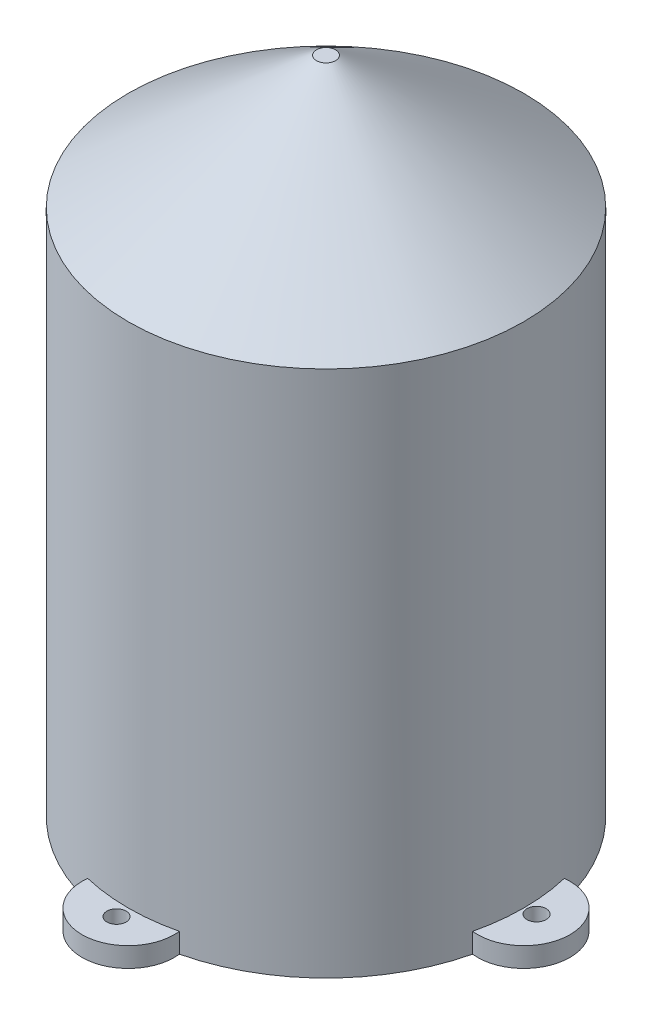
ISO-10303-21;
HEADER;
FILE_DESCRIPTION(('STEP AP214'),'2;1');
FILE_NAME('part.step','',(''),(''),'','','');
FILE_SCHEMA(('AUTOMOTIVE_DESIGN { 1 0 10303 214 1 1 1 1 }'));
ENDSEC;
DATA;
#1=APPLICATION_CONTEXT('core data for automotive mechanical design processes');
#2=APPLICATION_PROTOCOL_DEFINITION('international standard','automotive_design',2000,#1);
#3=PRODUCT_CONTEXT('',#1,'mechanical');
#4=PRODUCT('Part','Part','',(#3));
#5=PRODUCT_RELATED_PRODUCT_CATEGORY('part','',(#4));
#6=PRODUCT_DEFINITION_FORMATION('','',#4);
#7=PRODUCT_DEFINITION_CONTEXT('part definition',#1,'design');
#8=PRODUCT_DEFINITION('design','',#6,#7);
#9=PRODUCT_DEFINITION_SHAPE('','',#8);
#10=(LENGTH_UNIT() NAMED_UNIT(*) SI_UNIT(.MILLI.,.METRE.));
#11=(NAMED_UNIT(*) PLANE_ANGLE_UNIT() SI_UNIT($,.RADIAN.));
#12=(NAMED_UNIT(*) SI_UNIT($,.STERADIAN.) SOLID_ANGLE_UNIT());
#13=UNCERTAINTY_MEASURE_WITH_UNIT(LENGTH_MEASURE(1.E-05),#10,'distance_accuracy_value','');
#14=(GEOMETRIC_REPRESENTATION_CONTEXT(3) GLOBAL_UNCERTAINTY_ASSIGNED_CONTEXT((#13)) GLOBAL_UNIT_ASSIGNED_CONTEXT((#10,
#11,#12)) REPRESENTATION_CONTEXT('',''));
#15=CARTESIAN_POINT('',(0.,0.,0.));
#16=DIRECTION('',(0.,0.,1.));
#17=DIRECTION('',(1.,0.,0.));
#18=AXIS2_PLACEMENT_3D('',#15,#16,#17);
#19=CARTESIAN_POINT('',(0.,0.,0.));
#20=DIRECTION('',(0.,1.,0.));
#21=DIRECTION('',(0.,0.,1.));
#22=AXIS2_PLACEMENT_3D('',#19,#20,#21);
#23=PLANE('',#22);
#24=CARTESIAN_POINT('',(31.7694060586553,0.,-0.159245143150811));
#25=DIRECTION('',(0.,-1.,0.));
#26=DIRECTION('',(0.,0.,-1.));
#27=AXIS2_PLACEMENT_3D('',#24,#25,#26);
#28=CIRCLE('',#27,1.44999999999999);
#29=CARTESIAN_POINT('',(31.7694060586553,0.,-1.6092451431508));
#30=VERTEX_POINT('',#29);
#31=EDGE_CURVE('E304',#30,#30,#28,.T.);
#32=ORIENTED_EDGE('',*,*,#31,.F.);
#33=EDGE_LOOP('',(#32));
#34=FACE_BOUND('',#33,.T.);
#35=CARTESIAN_POINT('',(-32.7248769175622,0.,-0.318490286301964));
#36=DIRECTION('',(0.,-1.,0.));
#37=DIRECTION('',(0.,0.,-1.));
#38=AXIS2_PLACEMENT_3D('',#35,#36,#37);
#39=CIRCLE('',#38,1.44999999999999);
#40=CARTESIAN_POINT('',(-32.7248769175622,0.,-1.76849028630196));
#41=VERTEX_POINT('',#40);
#42=EDGE_CURVE('E138',#41,#41,#39,.T.);
#43=ORIENTED_EDGE('',*,*,#42,.F.);
#44=EDGE_LOOP('',(#43));
#45=FACE_BOUND('',#44,.T.);
#46=CARTESIAN_POINT('',(0.,0.,0.));
#47=DIRECTION('',(0.,1.,0.));
#48=DIRECTION('',(0.,0.,1.));
#49=AXIS2_PLACEMENT_3D('',#46,#47,#48);
#50=CIRCLE('',#49,28.);
#51=CARTESIAN_POINT('',(0.,0.,28.));
#52=VERTEX_POINT('',#51);
#53=EDGE_CURVE('E198',#52,#52,#50,.T.);
#54=ORIENTED_EDGE('',*,*,#53,.T.);
#55=EDGE_LOOP('',(#54));
#56=FACE_BOUND('',#55,.T.);
#57=CARTESIAN_POINT('',(0.,0.,0.));
#58=DIRECTION('',(0.,1.,0.));
#59=DIRECTION('',(0.,0.,1.));
#60=AXIS2_PLACEMENT_3D('',#57,#58,#59);
#61=CIRCLE('',#60,30.);
#62=CARTESIAN_POINT('',(29.1833333333333,0.,-6.95219789387181));
#63=VERTEX_POINT('',#62);
#64=CARTESIAN_POINT('',(6.95219789387171,0.,-29.1833333333334));
#65=VERTEX_POINT('',#64);
#66=EDGE_CURVE('E119',#63,#65,#61,.T.);
#67=ORIENTED_EDGE('',*,*,#66,.F.);
#68=CARTESIAN_POINT('',(30.,0.,0.));
#69=DIRECTION('',(0.,-1.,0.));
#70=DIRECTION('',(0.,0.,-1.));
#71=AXIS2_PLACEMENT_3D('',#68,#69,#70);
#72=CIRCLE('',#71,7.);
#73=CARTESIAN_POINT('',(29.1833333333333,0.,6.95219789387181));
#74=VERTEX_POINT('',#73);
#75=EDGE_CURVE('E178',#74,#63,#72,.F.);
#76=ORIENTED_EDGE('',*,*,#75,.F.);
#77=CARTESIAN_POINT('',(6.95219789387211,0.,29.1833333333333));
#78=VERTEX_POINT('',#77);
#79=EDGE_CURVE('E206',#78,#74,#61,.T.);
#80=ORIENTED_EDGE('',*,*,#79,.F.);
#81=CARTESIAN_POINT('',(3.14233320495882E-13,0.,30.));
#82=DIRECTION('',(0.,-1.,0.));
#83=DIRECTION('',(0.,0.,-1.));
#84=AXIS2_PLACEMENT_3D('',#81,#82,#83);
#85=CIRCLE('',#84,7.);
#86=CARTESIAN_POINT('',(-6.9521978938715,0.,29.1833333333334));
#87=VERTEX_POINT('',#86);
#88=EDGE_CURVE('E159',#87,#78,#85,.F.);
#89=ORIENTED_EDGE('',*,*,#88,.F.);
#90=CARTESIAN_POINT('',(-29.1833333333333,0.,6.95219789387201));
#91=VERTEX_POINT('',#90);
#92=EDGE_CURVE('E120',#91,#87,#61,.T.);
#93=ORIENTED_EDGE('',*,*,#92,.F.);
#94=CARTESIAN_POINT('',(-30.,0.,2.09488880330588E-13));
#95=DIRECTION('',(0.,-1.,0.));
#96=DIRECTION('',(0.,0.,-1.));
#97=AXIS2_PLACEMENT_3D('',#94,#95,#96);
#98=CIRCLE('',#97,7.);
#99=CARTESIAN_POINT('',(-29.1833333333334,0.,-6.9521978938716));
#100=VERTEX_POINT('',#99);
#101=EDGE_CURVE('E116',#100,#91,#98,.F.);
#102=ORIENTED_EDGE('',*,*,#101,.F.);
#103=CARTESIAN_POINT('',(-6.95219789387191,0.,-29.1833333333333));
#104=VERTEX_POINT('',#103);
#105=EDGE_CURVE('E111',#104,#100,#61,.T.);
#106=ORIENTED_EDGE('',*,*,#105,.F.);
#107=CARTESIAN_POINT('',(-1.04744440165294E-13,0.,-30.));
#108=DIRECTION('',(0.,-1.,0.));
#109=DIRECTION('',(0.,0.,-1.));
#110=AXIS2_PLACEMENT_3D('',#107,#108,#109);
#111=CIRCLE('',#110,7.);
#112=EDGE_CURVE('E114',#65,#104,#111,.F.);
#113=ORIENTED_EDGE('',*,*,#112,.F.);
#114=EDGE_LOOP('',(#67,#76,#80,#89,#93,#102,#106,#113));
#115=FACE_BOUND('',#114,.T.);
#116=CARTESIAN_POINT('',(-0.238867714726726,0.,-32.9637446322886));
#117=DIRECTION('',(0.,-1.,0.));
#118=DIRECTION('',(0.,0.,-1.));
#119=AXIS2_PLACEMENT_3D('',#116,#117,#118);
#120=CIRCLE('',#119,1.44999999999999);
#121=CARTESIAN_POINT('',(-0.238867714726726,0.,-34.4137446322886));
#122=VERTEX_POINT('',#121);
#123=EDGE_CURVE('E316',#122,#122,#120,.T.);
#124=ORIENTED_EDGE('',*,*,#123,.F.);
#125=EDGE_LOOP('',(#124));
#126=FACE_BOUND('',#125,.T.);
#127=CARTESIAN_POINT('',(0.23886771472674,0.,32.0082737733824));
#128=DIRECTION('',(0.,-1.,0.));
#129=DIRECTION('',(0.,0.,-1.));
#130=AXIS2_PLACEMENT_3D('',#127,#128,#129);
#131=CIRCLE('',#130,1.44999999999999);
#132=CARTESIAN_POINT('',(0.23886771472674,0.,30.5582737733824));
#133=VERTEX_POINT('',#132);
#134=EDGE_CURVE('E299',#133,#133,#131,.T.);
#135=ORIENTED_EDGE('',*,*,#134,.F.);
#136=EDGE_LOOP('',(#135));
#137=FACE_BOUND('',#136,.T.);
#138=ADVANCED_FACE('F45',(#34,#45,#56,#115,#126,#137),#23,.F.);
#139=CARTESIAN_POINT('',(0.,100.,0.));
#140=DIRECTION('',(0.,-1.,0.));
#141=DIRECTION('',(0.,0.,-1.));
#142=AXIS2_PLACEMENT_3D('',#139,#140,#141);
#143=CYLINDRICAL_SURFACE('',#142,30.);
#144=CARTESIAN_POINT('',(0.,80.,0.));
#145=DIRECTION('',(0.,1.,0.));
#146=DIRECTION('',(0.,0.,1.));
#147=AXIS2_PLACEMENT_3D('',#144,#145,#146);
#148=CIRCLE('',#147,30.);
#149=CARTESIAN_POINT('',(0.,80.,-30.));
#150=VERTEX_POINT('',#149);
#151=EDGE_CURVE('E11',#150,#150,#148,.F.);
#152=ORIENTED_EDGE('',*,*,#151,.T.);
#153=EDGE_LOOP('',(#152));
#154=FACE_BOUND('',#153,.T.);
#155=DIRECTION('',(0.,-1.,0.));
#156=VECTOR('',#155,1.);
#157=CARTESIAN_POINT('',(6.95219789387171,3.,-29.1833333333334));
#158=LINE('',#157,#156);
#159=CARTESIAN_POINT('',(6.9521978938717,3.,-29.1833333333334));
#160=VERTEX_POINT('',#159);
#161=EDGE_CURVE('E62',#160,#65,#158,.T.);
#162=ORIENTED_EDGE('',*,*,#161,.F.);
#163=CARTESIAN_POINT('',(0.,3.,0.));
#164=DIRECTION('',(0.,-1.,0.));
#165=DIRECTION('',(0.,0.,-1.));
#166=AXIS2_PLACEMENT_3D('',#163,#164,#165);
#167=CIRCLE('',#166,30.);
#168=CARTESIAN_POINT('',(-6.9521978938719,3.,-29.1833333333333));
#169=VERTEX_POINT('',#168);
#170=EDGE_CURVE('E66',#169,#160,#167,.T.);
#171=ORIENTED_EDGE('',*,*,#170,.F.);
#172=DIRECTION('',(0.,-1.,0.));
#173=VECTOR('',#172,1.);
#174=CARTESIAN_POINT('',(-6.95219789387191,3.,-29.1833333333333));
#175=LINE('',#174,#173);
#176=EDGE_CURVE('E123',#169,#104,#175,.T.);
#177=ORIENTED_EDGE('',*,*,#176,.T.);
#178=ORIENTED_EDGE('',*,*,#105,.T.);
#179=DIRECTION('',(0.,-1.,0.));
#180=VECTOR('',#179,1.);
#181=CARTESIAN_POINT('',(-29.1833333333334,3.,-6.9521978938716));
#182=LINE('',#181,#180);
#183=CARTESIAN_POINT('',(-29.1833333333334,3.,-6.9521978938716));
#184=VERTEX_POINT('',#183);
#185=EDGE_CURVE('E152',#184,#100,#182,.T.);
#186=ORIENTED_EDGE('',*,*,#185,.F.);
#187=CARTESIAN_POINT('',(0.,3.,0.));
#188=DIRECTION('',(0.,-1.,0.));
#189=DIRECTION('',(0.,0.,-1.));
#190=AXIS2_PLACEMENT_3D('',#187,#188,#189);
#191=CIRCLE('',#190,30.);
#192=CARTESIAN_POINT('',(-29.1833333333333,3.,6.95219789387201));
#193=VERTEX_POINT('',#192);
#194=EDGE_CURVE('E148',#193,#184,#191,.T.);
#195=ORIENTED_EDGE('',*,*,#194,.F.);
#196=DIRECTION('',(0.,-1.,0.));
#197=VECTOR('',#196,1.);
#198=CARTESIAN_POINT('',(-29.1833333333333,3.,6.95219789387201));
#199=LINE('',#198,#197);
#200=EDGE_CURVE('E155',#193,#91,#199,.T.);
#201=ORIENTED_EDGE('',*,*,#200,.T.);
#202=ORIENTED_EDGE('',*,*,#92,.T.);
#203=DIRECTION('',(0.,-1.,0.));
#204=VECTOR('',#203,1.);
#205=CARTESIAN_POINT('',(-6.9521978938715,3.,29.1833333333334));
#206=LINE('',#205,#204);
#207=CARTESIAN_POINT('',(-6.9521978938715,3.,29.1833333333334));
#208=VERTEX_POINT('',#207);
#209=EDGE_CURVE('E170',#208,#87,#206,.T.);
#210=ORIENTED_EDGE('',*,*,#209,.F.);
#211=CARTESIAN_POINT('',(0.,3.,0.));
#212=DIRECTION('',(0.,-1.,0.));
#213=DIRECTION('',(0.,0.,-1.));
#214=AXIS2_PLACEMENT_3D('',#211,#212,#213);
#215=CIRCLE('',#214,30.);
#216=CARTESIAN_POINT('',(6.95219789387211,3.,29.1833333333333));
#217=VERTEX_POINT('',#216);
#218=EDGE_CURVE('E166',#217,#208,#215,.T.);
#219=ORIENTED_EDGE('',*,*,#218,.F.);
#220=DIRECTION('',(0.,-1.,0.));
#221=VECTOR('',#220,1.);
#222=CARTESIAN_POINT('',(6.95219789387211,3.,29.1833333333333));
#223=LINE('',#222,#221);
#224=EDGE_CURVE('E174',#217,#78,#223,.T.);
#225=ORIENTED_EDGE('',*,*,#224,.T.);
#226=ORIENTED_EDGE('',*,*,#79,.T.);
#227=DIRECTION('',(0.,-1.,0.));
#228=VECTOR('',#227,1.);
#229=CARTESIAN_POINT('',(29.1833333333333,3.,6.95219789387181));
#230=LINE('',#229,#228);
#231=CARTESIAN_POINT('',(29.1833333333333,3.,6.9521978938718));
#232=VERTEX_POINT('',#231);
#233=EDGE_CURVE('E190',#232,#74,#230,.T.);
#234=ORIENTED_EDGE('',*,*,#233,.F.);
#235=CARTESIAN_POINT('',(0.,3.,0.));
#236=DIRECTION('',(0.,-1.,0.));
#237=DIRECTION('',(0.,0.,-1.));
#238=AXIS2_PLACEMENT_3D('',#235,#236,#237);
#239=CIRCLE('',#238,30.);
#240=CARTESIAN_POINT('',(29.1833333333333,3.,-6.9521978938718));
#241=VERTEX_POINT('',#240);
#242=EDGE_CURVE('E186',#241,#232,#239,.T.);
#243=ORIENTED_EDGE('',*,*,#242,.F.);
#244=DIRECTION('',(0.,-1.,0.));
#245=VECTOR('',#244,1.);
#246=CARTESIAN_POINT('',(29.1833333333333,3.,-6.95219789387181));
#247=LINE('',#246,#245);
#248=EDGE_CURVE('E194',#241,#63,#247,.T.);
#249=ORIENTED_EDGE('',*,*,#248,.T.);
#250=ORIENTED_EDGE('',*,*,#66,.T.);
#251=EDGE_LOOP('',(#162,#171,#177,#178,#186,#195,#201,#202,#210,#219,#225,#226,#234,#243,#249,#250));
#252=FACE_BOUND('',#251,.T.);
#253=ADVANCED_FACE('F124',(#154,#252),#143,.T.);
#254=CARTESIAN_POINT('',(0.,100.,0.));
#255=DIRECTION('',(0.,1.,0.));
#256=DIRECTION('',(0.,0.,1.));
#257=AXIS2_PLACEMENT_3D('',#254,#255,#256);
#258=PLANE('',#257);
#259=CARTESIAN_POINT('',(0.,100.,0.));
#260=DIRECTION('',(0.,1.,0.));
#261=DIRECTION('',(0.,0.,1.));
#262=AXIS2_PLACEMENT_3D('',#259,#260,#261);
#263=CIRCLE('',#262,1.43703986515772);
#264=CARTESIAN_POINT('',(0.,100.,-1.43703986515773));
#265=VERTEX_POINT('',#264);
#266=EDGE_CURVE('E55',#265,#265,#263,.T.);
#267=ORIENTED_EDGE('',*,*,#266,.T.);
#268=EDGE_LOOP('',(#267));
#269=FACE_BOUND('',#268,.T.);
#270=ADVANCED_FACE('F218',(#269),#258,.T.);
#271=CARTESIAN_POINT('',(0.,100.,0.));
#272=DIRECTION('',(0.,-1.,0.));
#273=DIRECTION('',(0.,0.,-1.));
#274=AXIS2_PLACEMENT_3D('',#271,#272,#273);
#275=CONICAL_SURFACE('',#274,1.43703986515772,0.95993108859688);
#276=CARTESIAN_POINT('',(0.,80.,-30.));
#277=CARTESIAN_POINT('',(0.,80.2083333333333,-29.7024691652621));
#278=CARTESIAN_POINT('',(0.,80.4166666666666,-29.4049383305241));
#279=CARTESIAN_POINT('',(0.,80.8333333333333,-28.8098766610483));
#280=CARTESIAN_POINT('',(0.,81.0416666666666,-28.5123458263103));
#281=CARTESIAN_POINT('',(0.,81.4583333333333,-27.9172841568344));
#282=CARTESIAN_POINT('',(0.,81.6666666666666,-27.6197533220965));
#283=CARTESIAN_POINT('',(0.,82.0833333333333,-27.0246916526206));
#284=CARTESIAN_POINT('',(0.,82.2916666666666,-26.7271608178827));
#285=CARTESIAN_POINT('',(0.,82.7083333333333,-26.1320991484068));
#286=CARTESIAN_POINT('',(0.,82.9166666666666,-25.8345683136688));
#287=CARTESIAN_POINT('',(0.,83.3333333333333,-25.239506644193));
#288=CARTESIAN_POINT('',(0.,83.5416666666666,-24.941975809455));
#289=CARTESIAN_POINT('',(0.,83.9583333333333,-24.3469141399791));
#290=CARTESIAN_POINT('',(0.,84.1666666666666,-24.0493833052412));
#291=CARTESIAN_POINT('',(0.,84.5833333333333,-23.4543216357653));
#292=CARTESIAN_POINT('',(0.,84.7916666666666,-23.1567908010274));
#293=CARTESIAN_POINT('',(0.,85.2083333333333,-22.5617291315515));
#294=CARTESIAN_POINT('',(0.,85.4166666666666,-22.2641982968136));
#295=CARTESIAN_POINT('',(0.,85.8333333333333,-21.6691366273377));
#296=CARTESIAN_POINT('',(0.,86.0416666666666,-21.3716057925997));
#297=CARTESIAN_POINT('',(0.,86.4583333333333,-20.7765441231239));
#298=CARTESIAN_POINT('',(0.,86.6666666666666,-20.4790132883859));
#299=CARTESIAN_POINT('',(0.,87.0833333333333,-19.88395161891));
#300=CARTESIAN_POINT('',(0.,87.2916666666666,-19.5864207841721));
#301=CARTESIAN_POINT('',(0.,87.7083333333333,-18.9913591146962));
#302=CARTESIAN_POINT('',(0.,87.9166666666666,-18.6938282799583));
#303=CARTESIAN_POINT('',(0.,88.3333333333333,-18.0987666104824));
#304=CARTESIAN_POINT('',(0.,88.5416666666666,-17.8012357757445));
#305=CARTESIAN_POINT('',(0.,88.9583333333333,-17.2061741062686));
#306=CARTESIAN_POINT('',(0.,89.1666666666666,-16.9086432715306));
#307=CARTESIAN_POINT('',(0.,89.5833333333333,-16.3135816020548));
#308=CARTESIAN_POINT('',(0.,89.7916666666666,-16.0160507673168));
#309=CARTESIAN_POINT('',(0.,90.2083333333333,-15.4209890978409));
#310=CARTESIAN_POINT('',(0.,90.4166666666666,-15.123458263103));
#311=CARTESIAN_POINT('',(0.,90.8333333333333,-14.5283965936271));
#312=CARTESIAN_POINT('',(0.,91.0416666666666,-14.2308657588892));
#313=CARTESIAN_POINT('',(0.,91.4583333333333,-13.6358040894133));
#314=CARTESIAN_POINT('',(0.,91.6666666666666,-13.3382732546754));
#315=CARTESIAN_POINT('',(0.,92.0833333333333,-12.7432115851995));
#316=CARTESIAN_POINT('',(0.,92.2916666666666,-12.4456807504615));
#317=CARTESIAN_POINT('',(0.,92.7083333333333,-11.8506190809856));
#318=CARTESIAN_POINT('',(0.,92.9166666666666,-11.5530882462477));
#319=CARTESIAN_POINT('',(0.,93.3333333333333,-10.9580265767718));
#320=CARTESIAN_POINT('',(0.,93.5416666666666,-10.6604957420339));
#321=CARTESIAN_POINT('',(0.,93.9583333333333,-10.065434072558));
#322=CARTESIAN_POINT('',(0.,94.1666666666666,-9.76790323782006));
#323=CARTESIAN_POINT('',(0.,94.5833333333333,-9.17284156834418));
#324=CARTESIAN_POINT('',(0.,94.7916666666666,-8.87531073360624));
#325=CARTESIAN_POINT('',(0.,95.2083333333333,-8.28024906413036));
#326=CARTESIAN_POINT('',(0.,95.4166666666666,-7.98271822939242));
#327=CARTESIAN_POINT('',(0.,95.8333333333333,-7.38765655991654));
#328=CARTESIAN_POINT('',(0.,96.0416666666667,-7.0901257251786));
#329=CARTESIAN_POINT('',(0.,96.4583333333333,-6.49506405570272));
#330=CARTESIAN_POINT('',(0.,96.6666666666667,-6.19753322096478));
#331=CARTESIAN_POINT('',(0.,97.0833333333333,-5.6024715514889));
#332=CARTESIAN_POINT('',(0.,97.2916666666667,-5.30494071675096));
#333=CARTESIAN_POINT('',(0.,97.7083333333333,-4.70987904727508));
#334=CARTESIAN_POINT('',(0.,97.9166666666667,-4.41234821253714));
#335=CARTESIAN_POINT('',(0.,98.3333333333333,-3.81728654306126));
#336=CARTESIAN_POINT('',(0.,98.5416666666667,-3.51975570832332));
#337=CARTESIAN_POINT('',(0.,98.9583333333333,-2.92469403884744));
#338=CARTESIAN_POINT('',(0.,99.1666666666667,-2.62716320410949));
#339=CARTESIAN_POINT('',(0.,99.5833333333333,-2.03210153463361));
#340=CARTESIAN_POINT('',(0.,99.7916666666667,-1.73457069989567));
#341=CARTESIAN_POINT('',(0.,100.,-1.43703986515773));
#342=B_SPLINE_CURVE_WITH_KNOTS('',3,(#276,#277,#278,#279,#280,#281,#282,#283,#284,#285,#286,
#287,#288,#289,#290,#291,#292,#293,#294,#295,#296,#297,#298,#299,#300,#301,#302,#303,#304,#305,
#306,#307,#308,#309,#310,#311,#312,#313,#314,#315,#316,#317,#318,#319,#320,#321,#322,#323,#324,
#325,#326,#327,#328,#329,#330,#331,#332,#333,#334,#335,#336,#337,#338,#339,#340,#341),
.UNSPECIFIED.,.F.,.F.,(4,2,2,2,2,2,2,2,2,2,2,2,2,2,2,2,2,2,2,2,2,2,2,2,2,2,2,2,2,2,2,2,4),(0.,
1.08965424726318,2.17930849452637,3.26896274178956,4.35861698905275,5.44827123631593,
6.53792548357912,7.62757973084231,8.71723397810549,9.80688822536868,10.8965424726319,
11.9861967198951,13.0758509671582,14.1655052144214,15.2551594616846,16.3448137089478,
17.434467956211,18.5241222034742,19.6137764507374,20.7034306980005,21.7930849452637,
22.8827391925269,23.9723934397901,25.0620476870533,26.1517019343165,27.2413561815797,
28.3310104288428,29.420664676106,30.5103189233692,31.5999731706324,32.6896274178956,
33.7792816651588,34.868935912422),.UNSPECIFIED.);
#343=EDGE_CURVE('BSEAM48',#150,#265,#342,.T.);
#344=ORIENTED_EDGE('',*,*,#151,.F.);
#345=ORIENTED_EDGE('',*,*,#266,.F.);
#346=ORIENTED_EDGE('',*,*,#343,.T.);
#347=ORIENTED_EDGE('',*,*,#343,.F.);
#348=EDGE_LOOP('',(#344,#346,#345,#347));
#349=FACE_BOUND('',#348,.T.);
#350=ADVANCED_FACE('F48',(#349),#275,.T.);
#351=CARTESIAN_POINT('',(0.,100.,0.));
#352=DIRECTION('',(0.,-1.,0.));
#353=DIRECTION('',(0.,0.,-1.));
#354=AXIS2_PLACEMENT_3D('',#351,#352,#353);
#355=CYLINDRICAL_SURFACE('',#354,28.);
#356=CARTESIAN_POINT('',(0.,78.9588658988965,0.));
#357=DIRECTION('',(0.,-1.,0.));
#358=DIRECTION('',(0.,0.,-1.));
#359=AXIS2_PLACEMENT_3D('',#356,#357,#358);
#360=CIRCLE('',#359,28.);
#361=CARTESIAN_POINT('',(0.,78.9588658988965,-28.));
#362=VERTEX_POINT('',#361);
#363=EDGE_CURVE('E202',#362,#362,#360,.T.);
#364=ORIENTED_EDGE('',*,*,#363,.F.);
#365=EDGE_LOOP('',(#364));
#366=FACE_BOUND('',#365,.T.);
#367=ORIENTED_EDGE('',*,*,#53,.F.);
#368=EDGE_LOOP('',(#367));
#369=FACE_BOUND('',#368,.T.);
#370=ADVANCED_FACE('F221',(#366,#369),#355,.F.);
#371=CARTESIAN_POINT('',(0.,98.,0.));
#372=DIRECTION('',(0.,1.,0.));
#373=DIRECTION('',(0.,0.,1.));
#374=AXIS2_PLACEMENT_3D('',#371,#372,#373);
#375=PLANE('',#374);
#376=CARTESIAN_POINT('',(0.,98.,0.));
#377=DIRECTION('',(0.,1.,0.));
#378=DIRECTION('',(0.,0.,1.));
#379=AXIS2_PLACEMENT_3D('',#376,#377,#378);
#380=CIRCLE('',#379,0.806442287399754);
#381=CARTESIAN_POINT('',(0.,98.,-0.806442287399764));
#382=VERTEX_POINT('',#381);
#383=EDGE_CURVE('E207',#382,#382,#380,.T.);
#384=ORIENTED_EDGE('',*,*,#383,.F.);
#385=EDGE_LOOP('',(#384));
#386=FACE_BOUND('',#385,.T.);
#387=ADVANCED_FACE('F227',(#386),#375,.F.);
#388=CARTESIAN_POINT('',(0.,98.361695911422,0.));
#389=DIRECTION('',(0.,-1.,0.));
#390=DIRECTION('',(0.,0.,-1.));
#391=AXIS2_PLACEMENT_3D('',#388,#389,#390);
#392=CONICAL_SURFACE('',#391,0.28988699245563,0.95993108859688);
#393=CARTESIAN_POINT('',(0.,78.9588658988965,-28.));
#394=CARTESIAN_POINT('',(0.,79.157211045783,-27.7167337738271));
#395=CARTESIAN_POINT('',(0.,79.3555561926695,-27.4334675476541));
#396=CARTESIAN_POINT('',(0.,79.7522464864425,-26.8669350953083));
#397=CARTESIAN_POINT('',(0.,79.950591633329,-26.5836688691354));
#398=CARTESIAN_POINT('',(0.,80.3472819271019,-26.0171364167895));
#399=CARTESIAN_POINT('',(0.,80.5456270739885,-25.7338701906166));
#400=CARTESIAN_POINT('',(0.,80.9423173677614,-25.1673377382708));
#401=CARTESIAN_POINT('',(0.,81.1406625146479,-24.8840715120979));
#402=CARTESIAN_POINT('',(0.,81.5373528084209,-24.317539059752));
#403=CARTESIAN_POINT('',(0.,81.7356979553074,-24.0342728335791));
#404=CARTESIAN_POINT('',(0.,82.1323882490804,-23.4677403812333));
#405=CARTESIAN_POINT('',(0.,82.3307333959669,-23.1844741550604));
#406=CARTESIAN_POINT('',(0.,82.7274236897399,-22.6179417027145));
#407=CARTESIAN_POINT('',(0.,82.9257688366264,-22.3346754765416));
#408=CARTESIAN_POINT('',(0.,83.3224591303994,-21.7681430241958));
#409=CARTESIAN_POINT('',(0.,83.5208042772859,-21.4848767980228));
#410=CARTESIAN_POINT('',(0.,83.9174945710589,-20.918344345677));
#411=CARTESIAN_POINT('',(0.,84.1158397179453,-20.6350781195041));
#412=CARTESIAN_POINT('',(0.,84.5125300117183,-20.0685456671583));
#413=CARTESIAN_POINT('',(0.,84.7108751586048,-19.7852794409853));
#414=CARTESIAN_POINT('',(0.,85.1075654523778,-19.2187469886395));
#415=CARTESIAN_POINT('',(0.,85.3059105992643,-18.9354807624666));
#416=CARTESIAN_POINT('',(0.,85.7026008930373,-18.3689483101207));
#417=CARTESIAN_POINT('',(0.,85.9009460399238,-18.0856820839478));
#418=CARTESIAN_POINT('',(0.,86.2976363336968,-17.519149631602));
#419=CARTESIAN_POINT('',(0.,86.4959814805833,-17.2358834054291));
#420=CARTESIAN_POINT('',(0.,86.8926717743563,-16.6693509530832));
#421=CARTESIAN_POINT('',(0.,87.0910169212428,-16.3860847269103));
#422=CARTESIAN_POINT('',(0.,87.4877072150157,-15.8195522745645));
#423=CARTESIAN_POINT('',(0.,87.6860523619023,-15.5362860483915));
#424=CARTESIAN_POINT('',(0.,88.0827426556752,-14.9697535960457));
#425=CARTESIAN_POINT('',(0.,88.2810878025617,-14.6864873698728));
#426=CARTESIAN_POINT('',(0.,88.6777780963347,-14.119954917527));
#427=CARTESIAN_POINT('',(0.,88.8761232432212,-13.836688691354));
#428=CARTESIAN_POINT('',(0.,89.2728135369942,-13.2701562390082));
#429=CARTESIAN_POINT('',(0.,89.4711586838807,-12.9868900128353));
#430=CARTESIAN_POINT('',(0.,89.8678489776537,-12.4203575604894));
#431=CARTESIAN_POINT('',(0.,90.0661941245402,-12.1370913343165));
#432=CARTESIAN_POINT('',(0.,90.4628844183132,-11.5705588819707));
#433=CARTESIAN_POINT('',(0.,90.6612295651997,-11.2872926557978));
#434=CARTESIAN_POINT('',(0.,91.0579198589727,-10.7207602034519));
#435=CARTESIAN_POINT('',(0.,91.2562650058592,-10.437493977279));
#436=CARTESIAN_POINT('',(0.,91.6529552996322,-9.87096152493317));
#437=CARTESIAN_POINT('',(0.,91.8513004465186,-9.58769529876025));
#438=CARTESIAN_POINT('',(0.,92.2479907402916,-9.02116284641441));
#439=CARTESIAN_POINT('',(0.,92.4463358871781,-8.73789662024149));
#440=CARTESIAN_POINT('',(0.,92.8430261809511,-8.17136416789566));
#441=CARTESIAN_POINT('',(0.,93.0413713278376,-7.88809794172274));
#442=CARTESIAN_POINT('',(0.,93.4380616216106,-7.3215654893769));
#443=CARTESIAN_POINT('',(0.,93.6364067684971,-7.03829926320398));
#444=CARTESIAN_POINT('',(0.,94.0330970622701,-6.47176681085814));
#445=CARTESIAN_POINT('',(0.,94.2314422091566,-6.18850058468522));
#446=CARTESIAN_POINT('',(0.,94.6281325029296,-5.62196813233938));
#447=CARTESIAN_POINT('',(0.,94.8264776498161,-5.33870190616646));
#448=CARTESIAN_POINT('',(0.,95.2231679435891,-4.77216945382063));
#449=CARTESIAN_POINT('',(0.,95.4215130904756,-4.48890322764771));
#450=CARTESIAN_POINT('',(0.,95.8182033842485,-3.92237077530187));
#451=CARTESIAN_POINT('',(0.,96.016548531135,-3.63910454912895));
#452=CARTESIAN_POINT('',(0.,96.413238824908,-3.07257209678312));
#453=CARTESIAN_POINT('',(0.,96.6115839717945,-2.7893058706102));
#454=CARTESIAN_POINT('',(0.,97.0082742655675,-2.22277341826436));
#455=CARTESIAN_POINT('',(0.,97.206619412454,-1.93950719209144));
#456=CARTESIAN_POINT('',(0.,97.603309706227,-1.3729747397456));
#457=CARTESIAN_POINT('',(0.,97.8016548531135,-1.08970851357268));
#458=CARTESIAN_POINT('',(0.,98.,-0.806442287399764));
#459=B_SPLINE_CURVE_WITH_KNOTS('',3,(#393,#394,#395,#396,#397,#398,#399,#400,#401,#402,#403,
#404,#405,#406,#407,#408,#409,#410,#411,#412,#413,#414,#415,#416,#417,#418,#419,#420,#421,#422,
#423,#424,#425,#426,#427,#428,#429,#430,#431,#432,#433,#434,#435,#436,#437,#438,#439,#440,#441,
#442,#443,#444,#445,#446,#447,#448,#449,#450,#451,#452,#453,#454,#455,#456,#457,#458),
.UNSPECIFIED.,.F.,.F.,(4,2,2,2,2,2,2,2,2,2,2,2,2,2,2,2,2,2,2,2,2,2,2,2,2,2,2,2,2,2,2,2,4),(0.,
1.03741263229877,2.07482526459754,3.1122378968963,4.14965052919507,5.18706316149382,
6.22447579379259,7.26188842609136,8.29930105839012,9.33671369068889,10.3741263229877,
11.4115389552864,12.4489515875852,13.4863642198839,14.5237768521827,15.5611894844815,
16.5986021167802,17.636014749079,18.6734273813778,19.7108400136765,20.7482526459753,
21.7856652782741,22.8230779105728,23.8604905428716,24.8979031751704,25.9353158074691,
26.9727284397679,28.0101410720667,29.0475537043654,30.0849663366642,31.1223789689629,
32.1597916012617,33.1972042335605),.UNSPECIFIED.);
#460=EDGE_CURVE('BSEAM242',#362,#382,#459,.T.);
#461=ORIENTED_EDGE('',*,*,#363,.T.);
#462=ORIENTED_EDGE('',*,*,#383,.T.);
#463=ORIENTED_EDGE('',*,*,#460,.T.);
#464=ORIENTED_EDGE('',*,*,#460,.F.);
#465=EDGE_LOOP('',(#461,#463,#462,#464));
#466=FACE_BOUND('',#465,.T.);
#467=ADVANCED_FACE('F242',(#466),#392,.F.);
#468=CARTESIAN_POINT('',(30.,3.,0.));
#469=DIRECTION('',(0.,-1.,0.));
#470=DIRECTION('',(0.,0.,-1.));
#471=AXIS2_PLACEMENT_3D('',#468,#469,#470);
#472=CYLINDRICAL_SURFACE('',#471,7.);
#473=ORIENTED_EDGE('',*,*,#75,.T.);
#474=ORIENTED_EDGE('',*,*,#248,.F.);
#475=CARTESIAN_POINT('',(30.,3.,0.));
#476=DIRECTION('',(0.,-1.,0.));
#477=DIRECTION('',(0.,0.,-1.));
#478=AXIS2_PLACEMENT_3D('',#475,#476,#477);
#479=CIRCLE('',#478,7.);
#480=EDGE_CURVE('E182',#232,#241,#479,.F.);
#481=ORIENTED_EDGE('',*,*,#480,.F.);
#482=ORIENTED_EDGE('',*,*,#233,.T.);
#483=EDGE_LOOP('',(#473,#474,#481,#482));
#484=FACE_BOUND('',#483,.T.);
#485=ADVANCED_FACE('F245',(#484),#472,.T.);
#486=CARTESIAN_POINT('',(0.,3.,0.));
#487=DIRECTION('',(0.,-1.,0.));
#488=DIRECTION('',(0.,0.,-1.));
#489=AXIS2_PLACEMENT_3D('',#486,#487,#488);
#490=PLANE('',#489);
#491=CARTESIAN_POINT('',(31.7694060586553,3.,-0.159245143150811));
#492=DIRECTION('',(0.,-1.,0.));
#493=DIRECTION('',(0.,0.,-1.));
#494=AXIS2_PLACEMENT_3D('',#491,#492,#493);
#495=CIRCLE('',#494,1.45);
#496=CARTESIAN_POINT('',(31.7694060586553,3.,-1.60924514315081));
#497=VERTEX_POINT('',#496);
#498=EDGE_CURVE('E309',#497,#497,#495,.T.);
#499=ORIENTED_EDGE('',*,*,#498,.T.);
#500=EDGE_LOOP('',(#499));
#501=FACE_BOUND('',#500,.T.);
#502=ORIENTED_EDGE('',*,*,#480,.T.);
#503=ORIENTED_EDGE('',*,*,#242,.T.);
#504=EDGE_LOOP('',(#502,#503));
#505=FACE_BOUND('',#504,.T.);
#506=ADVANCED_FACE('F252',(#501,#505),#490,.F.);
#507=CARTESIAN_POINT('',(3.14233320495882E-13,3.,30.));
#508=DIRECTION('',(0.,-1.,0.));
#509=DIRECTION('',(0.,0.,-1.));
#510=AXIS2_PLACEMENT_3D('',#507,#508,#509);
#511=CYLINDRICAL_SURFACE('',#510,7.);
#512=ORIENTED_EDGE('',*,*,#88,.T.);
#513=ORIENTED_EDGE('',*,*,#224,.F.);
#514=CARTESIAN_POINT('',(3.14233320495882E-13,3.,30.));
#515=DIRECTION('',(0.,-1.,0.));
#516=DIRECTION('',(0.,0.,-1.));
#517=AXIS2_PLACEMENT_3D('',#514,#515,#516);
#518=CIRCLE('',#517,7.);
#519=EDGE_CURVE('E162',#208,#217,#518,.F.);
#520=ORIENTED_EDGE('',*,*,#519,.F.);
#521=ORIENTED_EDGE('',*,*,#209,.T.);
#522=EDGE_LOOP('',(#512,#513,#520,#521));
#523=FACE_BOUND('',#522,.T.);
#524=ADVANCED_FACE('F256',(#523),#511,.T.);
#525=CARTESIAN_POINT('',(0.,3.,0.));
#526=DIRECTION('',(0.,-1.,0.));
#527=DIRECTION('',(0.,0.,-1.));
#528=AXIS2_PLACEMENT_3D('',#525,#526,#527);
#529=PLANE('',#528);
#530=CARTESIAN_POINT('',(0.23886771472674,3.,32.0082737733824));
#531=DIRECTION('',(0.,-1.,0.));
#532=DIRECTION('',(0.,0.,-1.));
#533=AXIS2_PLACEMENT_3D('',#530,#531,#532);
#534=CIRCLE('',#533,1.44999999999999);
#535=CARTESIAN_POINT('',(0.23886771472674,3.,30.5582737733824));
#536=VERTEX_POINT('',#535);
#537=EDGE_CURVE('E302',#536,#536,#534,.T.);
#538=ORIENTED_EDGE('',*,*,#537,.T.);
#539=EDGE_LOOP('',(#538));
#540=FACE_BOUND('',#539,.T.);
#541=ORIENTED_EDGE('',*,*,#519,.T.);
#542=ORIENTED_EDGE('',*,*,#218,.T.);
#543=EDGE_LOOP('',(#541,#542));
#544=FACE_BOUND('',#543,.T.);
#545=ADVANCED_FACE('F260',(#540,#544),#529,.F.);
#546=CARTESIAN_POINT('',(-30.,3.,2.09488880330588E-13));
#547=DIRECTION('',(0.,-1.,0.));
#548=DIRECTION('',(0.,0.,-1.));
#549=AXIS2_PLACEMENT_3D('',#546,#547,#548);
#550=CYLINDRICAL_SURFACE('',#549,7.);
#551=ORIENTED_EDGE('',*,*,#101,.T.);
#552=ORIENTED_EDGE('',*,*,#200,.F.);
#553=CARTESIAN_POINT('',(-30.,3.,2.09488880330588E-13));
#554=DIRECTION('',(0.,-1.,0.));
#555=DIRECTION('',(0.,0.,-1.));
#556=AXIS2_PLACEMENT_3D('',#553,#554,#555);
#557=CIRCLE('',#556,7.);
#558=EDGE_CURVE('E144',#184,#193,#557,.F.);
#559=ORIENTED_EDGE('',*,*,#558,.F.);
#560=ORIENTED_EDGE('',*,*,#185,.T.);
#561=EDGE_LOOP('',(#551,#552,#559,#560));
#562=FACE_BOUND('',#561,.T.);
#563=ADVANCED_FACE('F264',(#562),#550,.T.);
#564=CARTESIAN_POINT('',(0.,3.,0.));
#565=DIRECTION('',(0.,-1.,0.));
#566=DIRECTION('',(0.,0.,-1.));
#567=AXIS2_PLACEMENT_3D('',#564,#565,#566);
#568=PLANE('',#567);
#569=CARTESIAN_POINT('',(-32.7248769175622,3.,-0.318490286301964));
#570=DIRECTION('',(0.,-1.,0.));
#571=DIRECTION('',(0.,0.,-1.));
#572=AXIS2_PLACEMENT_3D('',#569,#570,#571);
#573=CIRCLE('',#572,1.45);
#574=CARTESIAN_POINT('',(-32.7248769175622,3.,-1.76849028630196));
#575=VERTEX_POINT('',#574);
#576=EDGE_CURVE('E132',#575,#575,#573,.T.);
#577=ORIENTED_EDGE('',*,*,#576,.T.);
#578=EDGE_LOOP('',(#577));
#579=FACE_BOUND('',#578,.T.);
#580=ORIENTED_EDGE('',*,*,#558,.T.);
#581=ORIENTED_EDGE('',*,*,#194,.T.);
#582=EDGE_LOOP('',(#580,#581));
#583=FACE_BOUND('',#582,.T.);
#584=ADVANCED_FACE('F268',(#579,#583),#568,.F.);
#585=CARTESIAN_POINT('',(-1.04744440165294E-13,3.,-30.));
#586=DIRECTION('',(0.,-1.,0.));
#587=DIRECTION('',(0.,0.,-1.));
#588=AXIS2_PLACEMENT_3D('',#585,#586,#587);
#589=CYLINDRICAL_SURFACE('',#588,7.);
#590=ORIENTED_EDGE('',*,*,#112,.T.);
#591=ORIENTED_EDGE('',*,*,#176,.F.);
#592=CARTESIAN_POINT('',(-1.04744440165294E-13,3.,-30.));
#593=DIRECTION('',(0.,-1.,0.));
#594=DIRECTION('',(0.,0.,-1.));
#595=AXIS2_PLACEMENT_3D('',#592,#593,#594);
#596=CIRCLE('',#595,7.);
#597=EDGE_CURVE('E131',#160,#169,#596,.F.);
#598=ORIENTED_EDGE('',*,*,#597,.F.);
#599=ORIENTED_EDGE('',*,*,#161,.T.);
#600=EDGE_LOOP('',(#590,#591,#598,#599));
#601=FACE_BOUND('',#600,.T.);
#602=ADVANCED_FACE('F129',(#601),#589,.T.);
#603=CARTESIAN_POINT('',(0.,3.,0.));
#604=DIRECTION('',(0.,-1.,0.));
#605=DIRECTION('',(0.,0.,-1.));
#606=AXIS2_PLACEMENT_3D('',#603,#604,#605);
#607=PLANE('',#606);
#608=CARTESIAN_POINT('',(-0.238867714726726,3.,-32.9637446322886));
#609=DIRECTION('',(0.,-1.,0.));
#610=DIRECTION('',(0.,0.,-1.));
#611=AXIS2_PLACEMENT_3D('',#608,#609,#610);
#612=CIRCLE('',#611,1.44999999999999);
#613=CARTESIAN_POINT('',(-0.238867714726726,3.,-34.4137446322886));
#614=VERTEX_POINT('',#613);
#615=EDGE_CURVE('E320',#614,#614,#612,.T.);
#616=ORIENTED_EDGE('',*,*,#615,.T.);
#617=EDGE_LOOP('',(#616));
#618=FACE_BOUND('',#617,.T.);
#619=ORIENTED_EDGE('',*,*,#597,.T.);
#620=ORIENTED_EDGE('',*,*,#170,.T.);
#621=EDGE_LOOP('',(#619,#620));
#622=FACE_BOUND('',#621,.T.);
#623=ADVANCED_FACE('F275',(#618,#622),#607,.F.);
#624=CARTESIAN_POINT('',(-32.7248769175622,0.,-0.318490286301964));
#625=DIRECTION('',(0.,-1.,0.));
#626=DIRECTION('',(0.,0.,-1.));
#627=AXIS2_PLACEMENT_3D('',#624,#625,#626);
#628=CYLINDRICAL_SURFACE('',#627,1.45);
#629=ORIENTED_EDGE('',*,*,#42,.T.);
#630=EDGE_LOOP('',(#629));
#631=FACE_BOUND('',#630,.T.);
#632=ORIENTED_EDGE('',*,*,#576,.F.);
#633=EDGE_LOOP('',(#632));
#634=FACE_BOUND('',#633,.T.);
#635=ADVANCED_FACE('F278',(#631,#634),#628,.F.);
#636=CARTESIAN_POINT('',(-0.238867714726726,0.,-32.9637446322886));
#637=DIRECTION('',(0.,-1.,0.));
#638=DIRECTION('',(0.,0.,-1.));
#639=AXIS2_PLACEMENT_3D('',#636,#637,#638);
#640=CYLINDRICAL_SURFACE('',#639,1.44999999999999);
#641=ORIENTED_EDGE('',*,*,#123,.T.);
#642=EDGE_LOOP('',(#641));
#643=FACE_BOUND('',#642,.T.);
#644=ORIENTED_EDGE('',*,*,#615,.F.);
#645=EDGE_LOOP('',(#644));
#646=FACE_BOUND('',#645,.T.);
#647=ADVANCED_FACE('F282',(#643,#646),#640,.F.);
#648=CARTESIAN_POINT('',(31.7694060586553,0.,-0.159245143150811));
#649=DIRECTION('',(0.,-1.,0.));
#650=DIRECTION('',(0.,0.,-1.));
#651=AXIS2_PLACEMENT_3D('',#648,#649,#650);
#652=CYLINDRICAL_SURFACE('',#651,1.45);
#653=ORIENTED_EDGE('',*,*,#31,.T.);
#654=EDGE_LOOP('',(#653));
#655=FACE_BOUND('',#654,.T.);
#656=ORIENTED_EDGE('',*,*,#498,.F.);
#657=EDGE_LOOP('',(#656));
#658=FACE_BOUND('',#657,.T.);
#659=ADVANCED_FACE('F286',(#655,#658),#652,.F.);
#660=CARTESIAN_POINT('',(0.23886771472674,0.,32.0082737733824));
#661=DIRECTION('',(0.,-1.,0.));
#662=DIRECTION('',(0.,0.,-1.));
#663=AXIS2_PLACEMENT_3D('',#660,#661,#662);
#664=CYLINDRICAL_SURFACE('',#663,1.44999999999999);
#665=ORIENTED_EDGE('',*,*,#134,.T.);
#666=EDGE_LOOP('',(#665));
#667=FACE_BOUND('',#666,.T.);
#668=ORIENTED_EDGE('',*,*,#537,.F.);
#669=EDGE_LOOP('',(#668));
#670=FACE_BOUND('',#669,.T.);
#671=ADVANCED_FACE('F290',(#667,#670),#664,.F.);
#672=CLOSED_SHELL('',(#138,#253,#270,#350,#370,#387,#467,#485,#506,#524,#545,#563,#584,#602,
#623,#635,#647,#659,#671));
#673=MANIFOLD_SOLID_BREP('B2',#672);
#674=ADVANCED_BREP_SHAPE_REPRESENTATION('',(#18,#673),#14);
#675=SHAPE_DEFINITION_REPRESENTATION(#9,#674);
ENDSEC;
END-ISO-10303-21;
